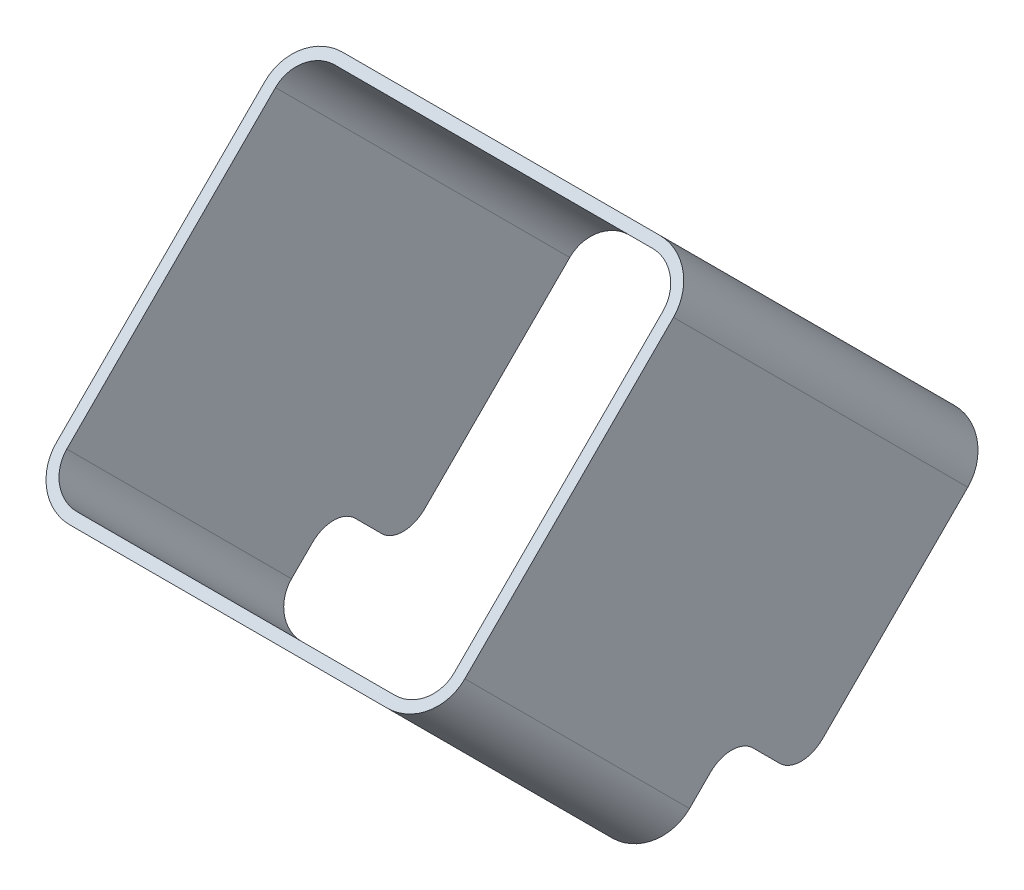
ISO-10303-21;
HEADER;
FILE_DESCRIPTION(('STEP AP214'),'2;1');
FILE_NAME('part.step','',(''),(''),'','','');
FILE_SCHEMA(('AUTOMOTIVE_DESIGN { 1 0 10303 214 1 1 1 1 }'));
ENDSEC;
DATA;
#1=APPLICATION_CONTEXT('core data for automotive mechanical design processes');
#2=APPLICATION_PROTOCOL_DEFINITION('international standard','automotive_design',2000,#1);
#3=PRODUCT_CONTEXT('',#1,'mechanical');
#4=PRODUCT('Part','Part','',(#3));
#5=PRODUCT_RELATED_PRODUCT_CATEGORY('part','',(#4));
#6=PRODUCT_DEFINITION_FORMATION('','',#4);
#7=PRODUCT_DEFINITION_CONTEXT('part definition',#1,'design');
#8=PRODUCT_DEFINITION('design','',#6,#7);
#9=PRODUCT_DEFINITION_SHAPE('','',#8);
#10=(LENGTH_UNIT() NAMED_UNIT(*) SI_UNIT(.MILLI.,.METRE.));
#11=(NAMED_UNIT(*) PLANE_ANGLE_UNIT() SI_UNIT($,.RADIAN.));
#12=(NAMED_UNIT(*) SI_UNIT($,.STERADIAN.) SOLID_ANGLE_UNIT());
#13=UNCERTAINTY_MEASURE_WITH_UNIT(LENGTH_MEASURE(1.E-05),#10,'distance_accuracy_value','');
#14=(GEOMETRIC_REPRESENTATION_CONTEXT(3) GLOBAL_UNCERTAINTY_ASSIGNED_CONTEXT((#13)) GLOBAL_UNIT_ASSIGNED_CONTEXT((#10,
#11,#12)) REPRESENTATION_CONTEXT('',''));
#15=CARTESIAN_POINT('',(0.,0.,0.));
#16=DIRECTION('',(0.,0.,1.));
#17=DIRECTION('',(1.,0.,0.));
#18=AXIS2_PLACEMENT_3D('',#15,#16,#17);
#19=CARTESIAN_POINT('',(73.0392137177238,-726.613094128826,-524.90850787991));
#20=DIRECTION('',(0.,0.707109355085686,0.70710420727804));
#21=DIRECTION('',(0.,-0.70710420727804,0.707109355085686));
#22=AXIS2_PLACEMENT_3D('',#19,#20,#21);
#23=CYLINDRICAL_SURFACE('',#22,2.3);
#24=CARTESIAN_POINT('',(73.0392137177238,-711.763797672026,-510.059319527071));
#25=DIRECTION('',(0.,0.707109355085686,0.70710420727804));
#26=DIRECTION('',(0.,-0.70710420727804,0.707109355085686));
#27=AXIS2_PLACEMENT_3D('',#24,#25,#26);
#28=CIRCLE('',#27,2.3);
#29=CARTESIAN_POINT('',(75.3392137177238,-711.763797672026,-510.059319527071));
#30=VERTEX_POINT('',#29);
#31=CARTESIAN_POINT('',(73.0392137177238,-713.390137348766,-508.432968010374));
#32=VERTEX_POINT('',#31);
#33=EDGE_CURVE('E294',#30,#32,#28,.F.);
#34=ORIENTED_EDGE('',*,*,#33,.F.);
#35=DIRECTION('',(0.,0.707109355085686,0.70710420727804));
#36=VECTOR('',#35,1.);
#37=CARTESIAN_POINT('',(75.3392137177238,-726.613094128826,-524.90850787991));
#38=LINE('',#37,#36);
#39=CARTESIAN_POINT('',(75.3392137177238,-726.613094128826,-524.90850787991));
#40=VERTEX_POINT('',#39);
#41=EDGE_CURVE('E334',#40,#30,#38,.T.);
#42=ORIENTED_EDGE('',*,*,#41,.F.);
#43=CARTESIAN_POINT('',(73.0392137177238,-726.613094128826,-524.90850787991));
#44=DIRECTION('',(0.,-0.707109355085686,-0.70710420727804));
#45=DIRECTION('',(1.,0.,0.));
#46=AXIS2_PLACEMENT_3D('',#43,#44,#45);
#47=CIRCLE('',#46,2.3);
#48=CARTESIAN_POINT('',(73.0392137177238,-728.239433805565,-523.282156363213));
#49=VERTEX_POINT('',#48);
#50=EDGE_CURVE('E324',#40,#49,#47,.T.);
#51=ORIENTED_EDGE('',*,*,#50,.T.);
#52=DIRECTION('',(0.,0.707109355085686,0.70710420727804));
#53=VECTOR('',#52,1.);
#54=CARTESIAN_POINT('',(73.0392137177238,-728.239433805565,-523.282156363213));
#55=LINE('',#54,#53);
#56=EDGE_CURVE('E329',#49,#32,#55,.T.);
#57=ORIENTED_EDGE('',*,*,#56,.T.);
#58=EDGE_LOOP('',(#34,#42,#51,#57));
#59=FACE_BOUND('',#58,.T.);
#60=ADVANCED_FACE('F16',(#59),#23,.F.);
#61=CARTESIAN_POINT('',(62.2040376067162,-728.239433805565,-523.282156363213));
#62=DIRECTION('',(0.,0.70710420727804,-0.707109355085686));
#63=DIRECTION('',(0.,0.707109355085686,0.70710420727804));
#64=AXIS2_PLACEMENT_3D('',#61,#62,#63);
#65=PLANE('',#64);
#66=DIRECTION('',(-1.,0.,0.));
#67=VECTOR('',#66,1.);
#68=CARTESIAN_POINT('',(62.5392137177238,-713.390137348766,-508.432968010374));
#69=LINE('',#68,#67);
#70=CARTESIAN_POINT('',(52.0392137177238,-713.390137348766,-508.432968010374));
#71=VERTEX_POINT('',#70);
#72=EDGE_CURVE('E376',#32,#71,#69,.T.);
#73=ORIENTED_EDGE('',*,*,#72,.F.);
#74=ORIENTED_EDGE('',*,*,#56,.F.);
#75=DIRECTION('',(-1.,0.,0.));
#76=VECTOR('',#75,1.);
#77=CARTESIAN_POINT('',(62.2040376067162,-728.239433805565,-523.282156363213));
#78=LINE('',#77,#76);
#79=CARTESIAN_POINT('',(52.0392137177238,-728.239433805565,-523.282156363213));
#80=VERTEX_POINT('',#79);
#81=EDGE_CURVE('E309',#49,#80,#78,.T.);
#82=ORIENTED_EDGE('',*,*,#81,.T.);
#83=DIRECTION('',(0.,0.707109355085686,0.70710420727804));
#84=VECTOR('',#83,1.);
#85=CARTESIAN_POINT('',(52.0392137177238,-728.239433805565,-523.282156363213));
#86=LINE('',#85,#84);
#87=EDGE_CURVE('E333',#80,#71,#86,.T.);
#88=ORIENTED_EDGE('',*,*,#87,.T.);
#89=EDGE_LOOP('',(#73,#74,#82,#88));
#90=FACE_BOUND('',#89,.T.);
#91=ADVANCED_FACE('F580',(#90),#65,.T.);
#92=CARTESIAN_POINT('',(52.0392137177238,-726.613094128826,-524.90850787991));
#93=DIRECTION('',(0.,0.707109355085686,0.70710420727804));
#94=DIRECTION('',(0.,-0.70710420727804,0.707109355085686));
#95=AXIS2_PLACEMENT_3D('',#92,#93,#94);
#96=CYLINDRICAL_SURFACE('',#95,2.3);
#97=CARTESIAN_POINT('',(52.0392137177238,-711.763797672026,-510.059319527071));
#98=DIRECTION('',(0.,0.707109355085686,0.70710420727804));
#99=DIRECTION('',(0.,-0.70710420727804,0.707109355085686));
#100=AXIS2_PLACEMENT_3D('',#97,#98,#99);
#101=CIRCLE('',#100,2.3);
#102=CARTESIAN_POINT('',(49.7392137177238,-711.763797672026,-510.059319527071));
#103=VERTEX_POINT('',#102);
#104=EDGE_CURVE('E424',#71,#103,#101,.F.);
#105=ORIENTED_EDGE('',*,*,#104,.F.);
#106=ORIENTED_EDGE('',*,*,#87,.F.);
#107=CARTESIAN_POINT('',(52.0392137177238,-726.613094128826,-524.90850787991));
#108=DIRECTION('',(0.,-0.707109355085686,-0.70710420727804));
#109=DIRECTION('',(0.,-0.707104207278068,0.707109355085658));
#110=AXIS2_PLACEMENT_3D('',#107,#108,#109);
#111=CIRCLE('',#110,2.3);
#112=CARTESIAN_POINT('',(49.7392137177238,-726.613094128826,-524.90850787991));
#113=VERTEX_POINT('',#112);
#114=EDGE_CURVE('E313',#80,#113,#111,.T.);
#115=ORIENTED_EDGE('',*,*,#114,.T.);
#116=DIRECTION('',(0.,0.707109355085686,0.70710420727804));
#117=VECTOR('',#116,1.);
#118=CARTESIAN_POINT('',(49.7392137177238,-726.613094128826,-524.90850787991));
#119=LINE('',#118,#117);
#120=EDGE_CURVE('E350',#113,#103,#119,.T.);
#121=ORIENTED_EDGE('',*,*,#120,.T.);
#122=EDGE_LOOP('',(#105,#106,#115,#121));
#123=FACE_BOUND('',#122,.T.);
#124=ADVANCED_FACE('F586',(#123),#96,.F.);
#125=CARTESIAN_POINT('',(49.7392137177238,-716.629178460247,-534.892496232651));
#126=DIRECTION('',(1.,0.,0.));
#127=DIRECTION('',(0.,0.,-1.));
#128=AXIS2_PLACEMENT_3D('',#125,#126,#127);
#129=PLANE('',#128);
#130=DIRECTION('',(0.,0.707109355085686,0.70710420727804));
#131=VECTOR('',#130,1.);
#132=CARTESIAN_POINT('',(49.7392137177238,-728.429866067909,-532.286972768276));
#133=LINE('',#132,#131);
#134=CARTESIAN_POINT('',(49.7392137177238,-727.014233139028,-530.871350145305));
#135=VERTEX_POINT('',#134);
#136=CARTESIAN_POINT('',(49.7392137177238,-725.246459751314,-529.10358962711));
#137=VERTEX_POINT('',#136);
#138=EDGE_CURVE('E280',#135,#137,#133,.T.);
#139=ORIENTED_EDGE('',*,*,#138,.F.);
#140=CARTESIAN_POINT('',(49.7392137177238,-725.600024724472,-532.285568855476));
#141=DIRECTION('',(1.,0.,0.));
#142=DIRECTION('',(0.,0.,-1.));
#143=AXIS2_PLACEMENT_3D('',#140,#141,#142);
#144=CIRCLE('',#143,2.);
#145=CARTESIAN_POINT('',(49.7392137177238,-727.014243434643,-533.699777270032));
#146=VERTEX_POINT('',#145);
#147=EDGE_CURVE('E447',#135,#146,#144,.T.);
#148=ORIENTED_EDGE('',*,*,#147,.T.);
#149=DIRECTION('',(0.,0.70710420727804,-0.707109355085686));
#150=VECTOR('',#149,1.);
#151=CARTESIAN_POINT('',(49.7392137177238,-721.225389268304,-539.488673579958));
#152=LINE('',#151,#150);
#153=CARTESIAN_POINT('',(49.7392137177238,-717.420772894961,-543.293317651388));
#154=VERTEX_POINT('',#153);
#155=EDGE_CURVE('E517',#146,#154,#152,.T.);
#156=ORIENTED_EDGE('',*,*,#155,.T.);
#157=DIRECTION('',(0.,0.707109355085686,0.70710420727804));
#158=VECTOR('',#157,1.);
#159=CARTESIAN_POINT('',(49.7392137177238,-712.824562086904,-538.697140304081));
#160=LINE('',#159,#158);
#161=CARTESIAN_POINT('',(49.7392137177238,-697.975265630105,-523.847951951242));
#162=VERTEX_POINT('',#161);
#163=EDGE_CURVE('E347',#154,#162,#160,.T.);
#164=ORIENTED_EDGE('',*,*,#163,.T.);
#165=DIRECTION('',(0.,0.70710420727804,-0.707109355085686));
#166=VECTOR('',#165,1.);
#167=CARTESIAN_POINT('',(49.7392137177238,-706.637292169261,-515.185862351442));
#168=LINE('',#167,#166);
#169=EDGE_CURVE('E420',#103,#162,#168,.T.);
#170=ORIENTED_EDGE('',*,*,#169,.F.);
#171=ORIENTED_EDGE('',*,*,#120,.F.);
#172=DIRECTION('',(0.,0.70710420727804,-0.707109355085686));
#173=VECTOR('',#172,1.);
#174=CARTESIAN_POINT('',(49.7392137177238,-716.629178460247,-534.892496232651));
#175=LINE('',#174,#173);
#176=CARTESIAN_POINT('',(49.7392137177238,-725.246449455698,-526.275162502383));
#177=VERTEX_POINT('',#176);
#178=EDGE_CURVE('E317',#113,#177,#175,.T.);
#179=ORIENTED_EDGE('',*,*,#178,.T.);
#180=CARTESIAN_POINT('',(49.7392137177238,-726.66066816587,-527.689370916939));
#181=DIRECTION('',(1.,0.,0.));
#182=DIRECTION('',(0.,0.,-1.));
#183=AXIS2_PLACEMENT_3D('',#180,#181,#182);
#184=CIRCLE('',#183,2.);
#185=EDGE_CURVE('E470',#177,#137,#184,.F.);
#186=ORIENTED_EDGE('',*,*,#185,.T.);
#187=EDGE_LOOP('',(#139,#148,#156,#164,#170,#171,#179,#186));
#188=FACE_BOUND('',#187,.T.);
#189=ADVANCED_FACE('F601',(#188),#129,.T.);
#190=CARTESIAN_POINT('',(52.0392137177238,-712.824562086904,-538.697140304081));
#191=DIRECTION('',(0.,0.707109355085686,0.70710420727804));
#192=DIRECTION('',(0.,-0.70710420727804,0.707109355085686));
#193=AXIS2_PLACEMENT_3D('',#190,#191,#192);
#194=CYLINDRICAL_SURFACE('',#193,2.3);
#195=CARTESIAN_POINT('',(52.0392137177238,-697.975265630105,-523.847951951242));
#196=DIRECTION('',(0.,0.707109355085686,0.70710420727804));
#197=DIRECTION('',(0.,-0.70710420727804,0.707109355085686));
#198=AXIS2_PLACEMENT_3D('',#195,#196,#197);
#199=CIRCLE('',#198,2.3);
#200=CARTESIAN_POINT('',(52.0392137177238,-696.348925953365,-525.474303467939));
#201=VERTEX_POINT('',#200);
#202=EDGE_CURVE('E416',#162,#201,#199,.F.);
#203=ORIENTED_EDGE('',*,*,#202,.F.);
#204=ORIENTED_EDGE('',*,*,#163,.F.);
#205=CARTESIAN_POINT('',(52.0392137177238,-717.420772894961,-543.293317651388));
#206=DIRECTION('',(0.,-0.707109355085686,-0.70710420727804));
#207=DIRECTION('',(0.,0.70710420727804,-0.707109355085686));
#208=AXIS2_PLACEMENT_3D('',#205,#206,#207);
#209=CIRCLE('',#208,2.3);
#210=CARTESIAN_POINT('',(52.0392137177238,-715.794433218221,-544.919669168085));
#211=VERTEX_POINT('',#210);
#212=EDGE_CURVE('E521',#154,#211,#209,.T.);
#213=ORIENTED_EDGE('',*,*,#212,.T.);
#214=DIRECTION('',(0.,0.707109355085686,0.70710420727804));
#215=VECTOR('',#214,1.);
#216=CARTESIAN_POINT('',(52.0392137177238,-711.198222410165,-540.323491820778));
#217=LINE('',#216,#215);
#218=EDGE_CURVE('E344',#211,#201,#217,.T.);
#219=ORIENTED_EDGE('',*,*,#218,.T.);
#220=EDGE_LOOP('',(#203,#204,#213,#219));
#221=FACE_BOUND('',#220,.T.);
#222=ADVANCED_FACE('F537',(#221),#194,.F.);
#223=CARTESIAN_POINT('',(62.5392137177238,-711.198222410165,-540.323491820778));
#224=DIRECTION('',(0.,0.70710420727804,-0.707109355085686));
#225=DIRECTION('',(0.,0.707109355085686,0.70710420727804));
#226=AXIS2_PLACEMENT_3D('',#223,#224,#225);
#227=PLANE('',#226);
#228=DIRECTION('',(-1.,0.,0.));
#229=VECTOR('',#228,1.);
#230=CARTESIAN_POINT('',(62.5392137177238,-696.348925953365,-525.474303467939));
#231=LINE('',#230,#229);
#232=CARTESIAN_POINT('',(73.0392137177238,-696.348925953365,-525.474303467939));
#233=VERTEX_POINT('',#232);
#234=EDGE_CURVE('E412',#233,#201,#231,.T.);
#235=ORIENTED_EDGE('',*,*,#234,.T.);
#236=ORIENTED_EDGE('',*,*,#218,.F.);
#237=DIRECTION('',(-1.,0.,0.));
#238=VECTOR('',#237,1.);
#239=CARTESIAN_POINT('',(62.5392137177238,-715.794433218221,-544.919669168085));
#240=LINE('',#239,#238);
#241=CARTESIAN_POINT('',(73.0392137177238,-715.794433218221,-544.919669168085));
#242=VERTEX_POINT('',#241);
#243=EDGE_CURVE('E493',#242,#211,#240,.T.);
#244=ORIENTED_EDGE('',*,*,#243,.F.);
#245=DIRECTION('',(0.,0.707109355085686,0.70710420727804));
#246=VECTOR('',#245,1.);
#247=CARTESIAN_POINT('',(73.0392137177238,-711.198222410165,-540.323491820778));
#248=LINE('',#247,#246);
#249=EDGE_CURVE('E341',#242,#233,#248,.T.);
#250=ORIENTED_EDGE('',*,*,#249,.T.);
#251=EDGE_LOOP('',(#235,#236,#244,#250));
#252=FACE_BOUND('',#251,.T.);
#253=ADVANCED_FACE('F532',(#252),#227,.F.);
#254=CARTESIAN_POINT('',(73.0392137177238,-712.824562086904,-538.697140304081));
#255=DIRECTION('',(0.,0.707109355085686,0.70710420727804));
#256=DIRECTION('',(0.,-0.70710420727804,0.707109355085686));
#257=AXIS2_PLACEMENT_3D('',#254,#255,#256);
#258=CYLINDRICAL_SURFACE('',#257,2.3);
#259=CARTESIAN_POINT('',(73.0392137177238,-697.975265630105,-523.847951951242));
#260=DIRECTION('',(0.,0.707109355085686,0.70710420727804));
#261=DIRECTION('',(0.,-0.70710420727804,0.707109355085686));
#262=AXIS2_PLACEMENT_3D('',#259,#260,#261);
#263=CIRCLE('',#262,2.3);
#264=CARTESIAN_POINT('',(75.3392137177238,-697.975265630105,-523.847951951242));
#265=VERTEX_POINT('',#264);
#266=EDGE_CURVE('E408',#233,#265,#263,.F.);
#267=ORIENTED_EDGE('',*,*,#266,.F.);
#268=ORIENTED_EDGE('',*,*,#249,.F.);
#269=CARTESIAN_POINT('',(73.0392137177238,-717.420772894961,-543.293317651388));
#270=DIRECTION('',(0.,-0.707109355085686,-0.70710420727804));
#271=DIRECTION('',(0.,0.70710420727804,-0.707109355085686));
#272=AXIS2_PLACEMENT_3D('',#269,#270,#271);
#273=CIRCLE('',#272,2.3);
#274=CARTESIAN_POINT('',(75.3392137177238,-717.420772894961,-543.293317651388));
#275=VERTEX_POINT('',#274);
#276=EDGE_CURVE('E243',#242,#275,#273,.T.);
#277=ORIENTED_EDGE('',*,*,#276,.T.);
#278=DIRECTION('',(0.,0.707109355085686,0.70710420727804));
#279=VECTOR('',#278,1.);
#280=CARTESIAN_POINT('',(75.3392137177238,-712.824562086904,-538.697140304081));
#281=LINE('',#280,#279);
#282=EDGE_CURVE('E337',#275,#265,#281,.T.);
#283=ORIENTED_EDGE('',*,*,#282,.T.);
#284=EDGE_LOOP('',(#267,#268,#277,#283));
#285=FACE_BOUND('',#284,.T.);
#286=ADVANCED_FACE('F528',(#285),#258,.F.);
#287=CARTESIAN_POINT('',(52.0392137177238,-726.613094128826,-524.90850787991));
#288=DIRECTION('',(0.,0.707109355085686,0.70710420727804));
#289=DIRECTION('',(0.,-0.70710420727804,0.707109355085686));
#290=AXIS2_PLACEMENT_3D('',#287,#288,#289);
#291=CYLINDRICAL_SURFACE('',#290,3.);
#292=CARTESIAN_POINT('',(52.0392137177238,-711.763797672026,-510.059319527071));
#293=DIRECTION('',(0.,0.707109355085686,0.70710420727804));
#294=DIRECTION('',(0.,-0.70710420727804,0.707109355085686));
#295=AXIS2_PLACEMENT_3D('',#292,#293,#294);
#296=CIRCLE('',#295,3.);
#297=CARTESIAN_POINT('',(52.0392137177238,-713.885110293861,-507.937991461814));
#298=VERTEX_POINT('',#297);
#299=CARTESIAN_POINT('',(49.0392137177238,-711.763797672026,-510.059319527071));
#300=VERTEX_POINT('',#299);
#301=EDGE_CURVE('E372',#298,#300,#296,.F.);
#302=ORIENTED_EDGE('',*,*,#301,.T.);
#303=DIRECTION('',(0.,0.707109355085686,0.70710420727804));
#304=VECTOR('',#303,1.);
#305=CARTESIAN_POINT('',(49.0392137177238,-726.613094128826,-524.90850787991));
#306=LINE('',#305,#304);
#307=CARTESIAN_POINT('',(49.0392137177238,-726.613094128826,-524.90850787991));
#308=VERTEX_POINT('',#307);
#309=EDGE_CURVE('E328',#308,#300,#306,.T.);
#310=ORIENTED_EDGE('',*,*,#309,.F.);
#311=CARTESIAN_POINT('',(52.0392137177238,-726.613094128826,-524.90850787991));
#312=DIRECTION('',(0.,-0.707109355085686,-0.70710420727804));
#313=DIRECTION('',(0.,-0.707104207278051,0.707109355085675));
#314=AXIS2_PLACEMENT_3D('',#311,#312,#313);
#315=CIRCLE('',#314,3.);
#316=CARTESIAN_POINT('',(52.0392137177238,-728.73440675066,-522.787179814653));
#317=VERTEX_POINT('',#316);
#318=EDGE_CURVE('E305',#317,#308,#315,.T.);
#319=ORIENTED_EDGE('',*,*,#318,.F.);
#320=DIRECTION('',(0.,0.707109355085686,0.70710420727804));
#321=VECTOR('',#320,1.);
#322=CARTESIAN_POINT('',(52.0392137177238,-728.73440675066,-522.787179814653));
#323=LINE('',#322,#321);
#324=EDGE_CURVE('E338',#317,#298,#323,.T.);
#325=ORIENTED_EDGE('',*,*,#324,.T.);
#326=EDGE_LOOP('',(#302,#310,#319,#325));
#327=FACE_BOUND('',#326,.T.);
#328=ADVANCED_FACE('F557',(#327),#291,.T.);
#329=CARTESIAN_POINT('',(62.2040376067162,-728.73440675066,-522.787179814653));
#330=DIRECTION('',(0.,0.70710420727804,-0.707109355085686));
#331=DIRECTION('',(0.,0.707109355085686,0.70710420727804));
#332=AXIS2_PLACEMENT_3D('',#329,#330,#331);
#333=PLANE('',#332);
#334=DIRECTION('',(-1.,0.,0.));
#335=VECTOR('',#334,1.);
#336=CARTESIAN_POINT('',(62.5392137177238,-713.885110293861,-507.937991461814));
#337=LINE('',#336,#335);
#338=CARTESIAN_POINT('',(73.0392137177238,-713.885110293861,-507.937991461814));
#339=VERTEX_POINT('',#338);
#340=EDGE_CURVE('E288',#339,#298,#337,.T.);
#341=ORIENTED_EDGE('',*,*,#340,.T.);
#342=ORIENTED_EDGE('',*,*,#324,.F.);
#343=DIRECTION('',(-1.,0.,0.));
#344=VECTOR('',#343,1.);
#345=CARTESIAN_POINT('',(62.2040376067162,-728.73440675066,-522.787179814653));
#346=LINE('',#345,#344);
#347=CARTESIAN_POINT('',(73.0392137177238,-728.73440675066,-522.787179814653));
#348=VERTEX_POINT('',#347);
#349=EDGE_CURVE('E289',#348,#317,#346,.T.);
#350=ORIENTED_EDGE('',*,*,#349,.F.);
#351=DIRECTION('',(0.,0.707109355085686,0.70710420727804));
#352=VECTOR('',#351,1.);
#353=CARTESIAN_POINT('',(73.0392137177238,-728.73440675066,-522.787179814653));
#354=LINE('',#353,#352);
#355=EDGE_CURVE('E357',#348,#339,#354,.T.);
#356=ORIENTED_EDGE('',*,*,#355,.T.);
#357=EDGE_LOOP('',(#341,#342,#350,#356));
#358=FACE_BOUND('',#357,.T.);
#359=ADVANCED_FACE('F568',(#358),#333,.F.);
#360=CARTESIAN_POINT('',(73.0392137177238,-726.613094128826,-524.90850787991));
#361=DIRECTION('',(0.,0.707109355085686,0.70710420727804));
#362=DIRECTION('',(0.,-0.70710420727804,0.707109355085686));
#363=AXIS2_PLACEMENT_3D('',#360,#361,#362);
#364=CYLINDRICAL_SURFACE('',#363,3.);
#365=CARTESIAN_POINT('',(73.0392137177238,-711.763797672026,-510.059319527071));
#366=DIRECTION('',(0.,0.707109355085686,0.70710420727804));
#367=DIRECTION('',(0.,-0.70710420727804,0.707109355085686));
#368=AXIS2_PLACEMENT_3D('',#365,#366,#367);
#369=CIRCLE('',#368,3.);
#370=CARTESIAN_POINT('',(76.0392137177238,-711.763797672026,-510.059319527071));
#371=VERTEX_POINT('',#370);
#372=EDGE_CURVE('E394',#371,#339,#369,.F.);
#373=ORIENTED_EDGE('',*,*,#372,.T.);
#374=ORIENTED_EDGE('',*,*,#355,.F.);
#375=CARTESIAN_POINT('',(73.0392137177238,-726.613094128826,-524.90850787991));
#376=DIRECTION('',(0.,-0.707109355085686,-0.70710420727804));
#377=DIRECTION('',(1.,0.,0.));
#378=AXIS2_PLACEMENT_3D('',#375,#376,#377);
#379=CIRCLE('',#378,3.);
#380=CARTESIAN_POINT('',(76.0392137177238,-726.613094128826,-524.90850787991));
#381=VERTEX_POINT('',#380);
#382=EDGE_CURVE('E293',#381,#348,#379,.T.);
#383=ORIENTED_EDGE('',*,*,#382,.F.);
#384=DIRECTION('',(0.,0.707109355085686,0.70710420727804));
#385=VECTOR('',#384,1.);
#386=CARTESIAN_POINT('',(76.0392137177238,-726.613094128826,-524.90850787991));
#387=LINE('',#386,#385);
#388=EDGE_CURVE('E254',#381,#371,#387,.T.);
#389=ORIENTED_EDGE('',*,*,#388,.T.);
#390=EDGE_LOOP('',(#373,#374,#383,#389));
#391=FACE_BOUND('',#390,.T.);
#392=ADVANCED_FACE('F566',(#391),#364,.T.);
#393=CARTESIAN_POINT('',(76.0392137177238,-718.499736553846,-533.021924521155));
#394=DIRECTION('',(1.,0.,0.));
#395=DIRECTION('',(0.,0.,-1.));
#396=AXIS2_PLACEMENT_3D('',#393,#394,#395);
#397=PLANE('',#396);
#398=DIRECTION('',(0.,0.707109355085686,0.70710420727804));
#399=VECTOR('',#398,1.);
#400=CARTESIAN_POINT('',(76.0392137177238,-728.429866067909,-532.286972768276));
#401=LINE('',#400,#399);
#402=CARTESIAN_POINT('',(76.0392137177238,-727.014233139028,-530.871350145305));
#403=VERTEX_POINT('',#402);
#404=CARTESIAN_POINT('',(76.0392137177238,-725.246459751314,-529.10358962711));
#405=VERTEX_POINT('',#404);
#406=EDGE_CURVE('E273',#403,#405,#401,.T.);
#407=ORIENTED_EDGE('',*,*,#406,.F.);
#408=CARTESIAN_POINT('',(76.0392137177238,-725.600024724472,-532.285568855476));
#409=DIRECTION('',(1.,0.,0.));
#410=DIRECTION('',(0.,0.,-1.));
#411=AXIS2_PLACEMENT_3D('',#408,#409,#410);
#412=CIRCLE('',#411,2.);
#413=CARTESIAN_POINT('',(76.0392137177238,-727.014243434643,-533.699777270032));
#414=VERTEX_POINT('',#413);
#415=EDGE_CURVE('E237',#403,#414,#412,.T.);
#416=ORIENTED_EDGE('',*,*,#415,.T.);
#417=DIRECTION('',(0.,0.70710420727804,-0.707109355085686));
#418=VECTOR('',#417,1.);
#419=CARTESIAN_POINT('',(76.0392137177238,-723.095947361902,-537.618101868462));
#420=LINE('',#419,#418);
#421=CARTESIAN_POINT('',(76.0392137177238,-717.420772894961,-543.293317651388));
#422=VERTEX_POINT('',#421);
#423=EDGE_CURVE('E230',#414,#422,#420,.T.);
#424=ORIENTED_EDGE('',*,*,#423,.T.);
#425=DIRECTION('',(0.,0.707109355085686,0.70710420727804));
#426=VECTOR('',#425,1.);
#427=CARTESIAN_POINT('',(76.0392137177238,-712.824562086904,-538.697140304081));
#428=LINE('',#427,#426);
#429=CARTESIAN_POINT('',(76.0392137177238,-697.975265630105,-523.847951951242));
#430=VERTEX_POINT('',#429);
#431=EDGE_CURVE('E234',#422,#430,#428,.T.);
#432=ORIENTED_EDGE('',*,*,#431,.T.);
#433=DIRECTION('',(0.,0.70710420727804,-0.707109355085686));
#434=VECTOR('',#433,1.);
#435=CARTESIAN_POINT('',(76.0392137177238,-706.637292169261,-515.185862351442));
#436=LINE('',#435,#434);
#437=EDGE_CURVE('E391',#371,#430,#436,.T.);
#438=ORIENTED_EDGE('',*,*,#437,.F.);
#439=ORIENTED_EDGE('',*,*,#388,.F.);
#440=DIRECTION('',(0.,0.70710420727804,-0.707109355085686));
#441=VECTOR('',#440,1.);
#442=CARTESIAN_POINT('',(76.0392137177238,-718.499736553846,-533.021924521155));
#443=LINE('',#442,#441);
#444=CARTESIAN_POINT('',(76.0392137177238,-725.246449455698,-526.275162502383));
#445=VERTEX_POINT('',#444);
#446=EDGE_CURVE('E298',#381,#445,#443,.T.);
#447=ORIENTED_EDGE('',*,*,#446,.T.);
#448=CARTESIAN_POINT('',(76.0392137177238,-726.66066816587,-527.689370916939));
#449=DIRECTION('',(1.,0.,0.));
#450=DIRECTION('',(0.,0.,-1.));
#451=AXIS2_PLACEMENT_3D('',#448,#449,#450);
#452=CIRCLE('',#451,2.);
#453=EDGE_CURVE('E10',#445,#405,#452,.F.);
#454=ORIENTED_EDGE('',*,*,#453,.T.);
#455=EDGE_LOOP('',(#407,#416,#424,#432,#438,#439,#447,#454));
#456=FACE_BOUND('',#455,.T.);
#457=ADVANCED_FACE('F232',(#456),#397,.T.);
#458=CARTESIAN_POINT('',(73.0392137177238,-712.824562086904,-538.697140304081));
#459=DIRECTION('',(0.,0.707109355085686,0.70710420727804));
#460=DIRECTION('',(0.,-0.70710420727804,0.707109355085686));
#461=AXIS2_PLACEMENT_3D('',#458,#459,#460);
#462=CYLINDRICAL_SURFACE('',#461,3.);
#463=CARTESIAN_POINT('',(73.0392137177238,-697.975265630105,-523.847951951242));
#464=DIRECTION('',(0.,0.707109355085686,0.70710420727804));
#465=DIRECTION('',(0.,-0.70710420727804,0.707109355085686));
#466=AXIS2_PLACEMENT_3D('',#463,#464,#465);
#467=CIRCLE('',#466,3.);
#468=CARTESIAN_POINT('',(73.0392137177238,-695.85395300827,-525.969280016499));
#469=VERTEX_POINT('',#468);
#470=EDGE_CURVE('E251',#469,#430,#467,.F.);
#471=ORIENTED_EDGE('',*,*,#470,.T.);
#472=ORIENTED_EDGE('',*,*,#431,.F.);
#473=CARTESIAN_POINT('',(73.0392137177238,-717.420772894961,-543.293317651388));
#474=DIRECTION('',(0.,-0.707109355085686,-0.70710420727804));
#475=DIRECTION('',(0.,0.70710420727804,-0.707109355085686));
#476=AXIS2_PLACEMENT_3D('',#473,#474,#475);
#477=CIRCLE('',#476,3.);
#478=CARTESIAN_POINT('',(73.0392137177238,-715.299460273127,-545.414645716645));
#479=VERTEX_POINT('',#478);
#480=EDGE_CURVE('E249',#479,#422,#477,.T.);
#481=ORIENTED_EDGE('',*,*,#480,.F.);
#482=DIRECTION('',(0.,0.707109355085686,0.70710420727804));
#483=VECTOR('',#482,1.);
#484=CARTESIAN_POINT('',(73.0392137177238,-710.70324946507,-540.818468369338));
#485=LINE('',#484,#483);
#486=EDGE_CURVE('E255',#479,#469,#485,.T.);
#487=ORIENTED_EDGE('',*,*,#486,.T.);
#488=EDGE_LOOP('',(#471,#472,#481,#487));
#489=FACE_BOUND('',#488,.T.);
#490=ADVANCED_FACE('F248',(#489),#462,.T.);
#491=CARTESIAN_POINT('',(62.5392137177238,-710.70324946507,-540.818468369338));
#492=DIRECTION('',(0.,0.70710420727804,-0.707109355085686));
#493=DIRECTION('',(0.,0.707109355085686,0.70710420727804));
#494=AXIS2_PLACEMENT_3D('',#491,#492,#493);
#495=PLANE('',#494);
#496=DIRECTION('',(-1.,0.,0.));
#497=VECTOR('',#496,1.);
#498=CARTESIAN_POINT('',(62.5392137177238,-695.85395300827,-525.969280016499));
#499=LINE('',#498,#497);
#500=CARTESIAN_POINT('',(52.0392137177238,-695.853953008271,-525.969280016499));
#501=VERTEX_POINT('',#500);
#502=EDGE_CURVE('E385',#469,#501,#499,.T.);
#503=ORIENTED_EDGE('',*,*,#502,.F.);
#504=ORIENTED_EDGE('',*,*,#486,.F.);
#505=DIRECTION('',(-1.,0.,0.));
#506=VECTOR('',#505,1.);
#507=CARTESIAN_POINT('',(62.5392137177238,-715.299460273127,-545.414645716645));
#508=LINE('',#507,#506);
#509=CARTESIAN_POINT('',(52.0392137177238,-715.299460273127,-545.414645716645));
#510=VERTEX_POINT('',#509);
#511=EDGE_CURVE('E262',#479,#510,#508,.T.);
#512=ORIENTED_EDGE('',*,*,#511,.T.);
#513=DIRECTION('',(0.,0.707109355085686,0.70710420727804));
#514=VECTOR('',#513,1.);
#515=CARTESIAN_POINT('',(52.0392137177238,-710.70324946507,-540.818468369338));
#516=LINE('',#515,#514);
#517=EDGE_CURVE('E363',#510,#501,#516,.T.);
#518=ORIENTED_EDGE('',*,*,#517,.T.);
#519=EDGE_LOOP('',(#503,#504,#512,#518));
#520=FACE_BOUND('',#519,.T.);
#521=ADVANCED_FACE('F515',(#520),#495,.T.);
#522=CARTESIAN_POINT('',(52.0392137177238,-712.824562086904,-538.697140304081));
#523=DIRECTION('',(0.,0.707109355085686,0.70710420727804));
#524=DIRECTION('',(0.,-0.70710420727804,0.707109355085686));
#525=AXIS2_PLACEMENT_3D('',#522,#523,#524);
#526=CYLINDRICAL_SURFACE('',#525,3.);
#527=CARTESIAN_POINT('',(52.0392137177238,-697.975265630105,-523.847951951242));
#528=DIRECTION('',(0.,0.707109355085686,0.70710420727804));
#529=DIRECTION('',(0.,-0.70710420727804,0.707109355085686));
#530=AXIS2_PLACEMENT_3D('',#527,#528,#529);
#531=CIRCLE('',#530,3.);
#532=CARTESIAN_POINT('',(49.0392137177238,-697.975265630105,-523.847951951242));
#533=VERTEX_POINT('',#532);
#534=EDGE_CURVE('E381',#533,#501,#531,.F.);
#535=ORIENTED_EDGE('',*,*,#534,.T.);
#536=ORIENTED_EDGE('',*,*,#517,.F.);
#537=CARTESIAN_POINT('',(52.0392137177238,-717.420772894961,-543.293317651388));
#538=DIRECTION('',(0.,-0.707109355085686,-0.70710420727804));
#539=DIRECTION('',(0.,0.70710420727804,-0.707109355085686));
#540=AXIS2_PLACEMENT_3D('',#537,#538,#539);
#541=CIRCLE('',#540,3.);
#542=CARTESIAN_POINT('',(49.0392137177238,-717.420772894961,-543.293317651388));
#543=VERTEX_POINT('',#542);
#544=EDGE_CURVE('E264',#543,#510,#541,.T.);
#545=ORIENTED_EDGE('',*,*,#544,.F.);
#546=DIRECTION('',(0.,0.707109355085686,0.70710420727804));
#547=VECTOR('',#546,1.);
#548=CARTESIAN_POINT('',(49.0392137177238,-712.824562086904,-538.697140304081));
#549=LINE('',#548,#547);
#550=EDGE_CURVE('E360',#543,#533,#549,.T.);
#551=ORIENTED_EDGE('',*,*,#550,.T.);
#552=EDGE_LOOP('',(#535,#536,#545,#551));
#553=FACE_BOUND('',#552,.T.);
#554=ADVANCED_FACE('F512',(#553),#526,.T.);
#555=CARTESIAN_POINT('',(49.0392137177238,-716.629178460247,-534.892496232651));
#556=DIRECTION('',(1.,0.,0.));
#557=DIRECTION('',(0.,0.,-1.));
#558=AXIS2_PLACEMENT_3D('',#555,#556,#557);
#559=PLANE('',#558);
#560=DIRECTION('',(0.,0.70710420727804,-0.707109355085686));
#561=VECTOR('',#560,1.);
#562=CARTESIAN_POINT('',(49.0392137177238,-721.225389268304,-539.488673579958));
#563=LINE('',#562,#561);
#564=CARTESIAN_POINT('',(49.0392137177238,-727.014243434643,-533.699777270032));
#565=VERTEX_POINT('',#564);
#566=EDGE_CURVE('E269',#565,#543,#563,.T.);
#567=ORIENTED_EDGE('',*,*,#566,.F.);
#568=CARTESIAN_POINT('',(49.0392137177238,-725.600024724472,-532.285568855476));
#569=DIRECTION('',(1.,0.,0.));
#570=DIRECTION('',(0.,0.,-1.));
#571=AXIS2_PLACEMENT_3D('',#568,#569,#570);
#572=CIRCLE('',#571,2.);
#573=CARTESIAN_POINT('',(49.0392137177238,-727.014233139028,-530.871350145305));
#574=VERTEX_POINT('',#573);
#575=EDGE_CURVE('E437',#565,#574,#572,.F.);
#576=ORIENTED_EDGE('',*,*,#575,.T.);
#577=DIRECTION('',(0.,0.707109355085686,0.70710420727804));
#578=VECTOR('',#577,1.);
#579=CARTESIAN_POINT('',(49.0392137177238,-728.429866067909,-532.286972768276));
#580=LINE('',#579,#578);
#581=CARTESIAN_POINT('',(49.0392137177238,-725.246459751314,-529.10358962711));
#582=VERTEX_POINT('',#581);
#583=EDGE_CURVE('E284',#574,#582,#580,.T.);
#584=ORIENTED_EDGE('',*,*,#583,.T.);
#585=CARTESIAN_POINT('',(49.0392137177238,-726.66066816587,-527.689370916939));
#586=DIRECTION('',(1.,0.,0.));
#587=DIRECTION('',(0.,0.,-1.));
#588=AXIS2_PLACEMENT_3D('',#585,#586,#587);
#589=CIRCLE('',#588,2.);
#590=CARTESIAN_POINT('',(49.0392137177238,-725.246449455698,-526.275162502383));
#591=VERTEX_POINT('',#590);
#592=EDGE_CURVE('E467',#582,#591,#589,.T.);
#593=ORIENTED_EDGE('',*,*,#592,.T.);
#594=DIRECTION('',(0.,0.70710420727804,-0.707109355085686));
#595=VECTOR('',#594,1.);
#596=CARTESIAN_POINT('',(49.0392137177238,-716.629178460247,-534.892496232651));
#597=LINE('',#596,#595);
#598=EDGE_CURVE('E301',#308,#591,#597,.T.);
#599=ORIENTED_EDGE('',*,*,#598,.F.);
#600=ORIENTED_EDGE('',*,*,#309,.T.);
#601=DIRECTION('',(0.,0.70710420727804,-0.707109355085686));
#602=VECTOR('',#601,1.);
#603=CARTESIAN_POINT('',(49.0392137177238,-706.637292169261,-515.185862351442));
#604=LINE('',#603,#602);
#605=EDGE_CURVE('E377',#300,#533,#604,.T.);
#606=ORIENTED_EDGE('',*,*,#605,.T.);
#607=ORIENTED_EDGE('',*,*,#550,.F.);
#608=EDGE_LOOP('',(#567,#576,#584,#593,#599,#600,#606,#607));
#609=FACE_BOUND('',#608,.T.);
#610=ADVANCED_FACE('F508',(#609),#559,.F.);
#611=CARTESIAN_POINT('',(75.3392137177238,-718.499736553846,-533.021924521155));
#612=DIRECTION('',(1.,0.,0.));
#613=DIRECTION('',(0.,0.,-1.));
#614=AXIS2_PLACEMENT_3D('',#611,#612,#613);
#615=PLANE('',#614);
#616=DIRECTION('',(0.,0.70710420727804,-0.707109355085686));
#617=VECTOR('',#616,1.);
#618=CARTESIAN_POINT('',(75.3392137177238,-723.095947361902,-537.618101868462));
#619=LINE('',#618,#617);
#620=CARTESIAN_POINT('',(75.3392137177238,-727.014243434643,-533.699777270032));
#621=VERTEX_POINT('',#620);
#622=EDGE_CURVE('E244',#621,#275,#619,.T.);
#623=ORIENTED_EDGE('',*,*,#622,.F.);
#624=CARTESIAN_POINT('',(75.3392137177238,-725.600024724472,-532.285568855476));
#625=DIRECTION('',(1.,0.,0.));
#626=DIRECTION('',(0.,0.,-1.));
#627=AXIS2_PLACEMENT_3D('',#624,#625,#626);
#628=CIRCLE('',#627,2.);
#629=CARTESIAN_POINT('',(75.3392137177238,-727.014233139028,-530.871350145305));
#630=VERTEX_POINT('',#629);
#631=EDGE_CURVE('E450',#621,#630,#628,.F.);
#632=ORIENTED_EDGE('',*,*,#631,.T.);
#633=DIRECTION('',(0.,0.707109355085686,0.70710420727804));
#634=VECTOR('',#633,1.);
#635=CARTESIAN_POINT('',(75.3392137177238,-728.429866067909,-532.286972768276));
#636=LINE('',#635,#634);
#637=CARTESIAN_POINT('',(75.3392137177238,-725.246459751314,-529.10358962711));
#638=VERTEX_POINT('',#637);
#639=EDGE_CURVE('E276',#630,#638,#636,.T.);
#640=ORIENTED_EDGE('',*,*,#639,.T.);
#641=CARTESIAN_POINT('',(75.3392137177238,-726.66066816587,-527.689370916939));
#642=DIRECTION('',(1.,0.,0.));
#643=DIRECTION('',(0.,0.,-1.));
#644=AXIS2_PLACEMENT_3D('',#641,#642,#643);
#645=CIRCLE('',#644,2.);
#646=CARTESIAN_POINT('',(75.3392137177238,-725.246449455698,-526.275162502383));
#647=VERTEX_POINT('',#646);
#648=EDGE_CURVE('E25',#638,#647,#645,.T.);
#649=ORIENTED_EDGE('',*,*,#648,.T.);
#650=DIRECTION('',(0.,0.70710420727804,-0.707109355085686));
#651=VECTOR('',#650,1.);
#652=CARTESIAN_POINT('',(75.3392137177238,-718.499736553846,-533.021924521155));
#653=LINE('',#652,#651);
#654=EDGE_CURVE('E321',#40,#647,#653,.T.);
#655=ORIENTED_EDGE('',*,*,#654,.F.);
#656=ORIENTED_EDGE('',*,*,#41,.T.);
#657=DIRECTION('',(0.,0.70710420727804,-0.707109355085686));
#658=VECTOR('',#657,1.);
#659=CARTESIAN_POINT('',(75.3392137177238,-706.637292169261,-515.185862351442));
#660=LINE('',#659,#658);
#661=EDGE_CURVE('E404',#30,#265,#660,.T.);
#662=ORIENTED_EDGE('',*,*,#661,.T.);
#663=ORIENTED_EDGE('',*,*,#282,.F.);
#664=EDGE_LOOP('',(#623,#632,#640,#649,#655,#656,#662,#663));
#665=FACE_BOUND('',#664,.T.);
#666=ADVANCED_FACE('F477',(#665),#615,.F.);
#667=CARTESIAN_POINT('',(62.5392137177238,-721.48658862606,-530.035050704281));
#668=DIRECTION('',(0.,0.707109355085686,0.70710420727804));
#669=DIRECTION('',(-1.,0.,0.));
#670=AXIS2_PLACEMENT_3D('',#667,#668,#669);
#671=PLANE('',#670);
#672=ORIENTED_EDGE('',*,*,#598,.T.);
#673=DIRECTION('',(-1.,0.,0.));
#674=VECTOR('',#673,1.);
#675=CARTESIAN_POINT('',(49.7392137177238,-725.246449455698,-526.275162502383));
#676=LINE('',#675,#674);
#677=EDGE_CURVE('E464',#591,#177,#676,.F.);
#678=ORIENTED_EDGE('',*,*,#677,.T.);
#679=ORIENTED_EDGE('',*,*,#178,.F.);
#680=ORIENTED_EDGE('',*,*,#114,.F.);
#681=ORIENTED_EDGE('',*,*,#81,.F.);
#682=ORIENTED_EDGE('',*,*,#50,.F.);
#683=ORIENTED_EDGE('',*,*,#654,.T.);
#684=DIRECTION('',(-1.,0.,0.));
#685=VECTOR('',#684,1.);
#686=CARTESIAN_POINT('',(76.0392137177238,-725.246449455698,-526.275162502383));
#687=LINE('',#686,#685);
#688=EDGE_CURVE('E37',#647,#445,#687,.F.);
#689=ORIENTED_EDGE('',*,*,#688,.T.);
#690=ORIENTED_EDGE('',*,*,#446,.F.);
#691=ORIENTED_EDGE('',*,*,#382,.T.);
#692=ORIENTED_EDGE('',*,*,#349,.T.);
#693=ORIENTED_EDGE('',*,*,#318,.T.);
#694=EDGE_LOOP('',(#672,#678,#679,#680,#681,#682,#683,#689,#690,#691,#692,#693));
#695=FACE_BOUND('',#694,.T.);
#696=ADVANCED_FACE('F482',(#695),#671,.F.);
#697=CARTESIAN_POINT('',(62.5392137177238,-706.637292169261,-515.185862351442));
#698=DIRECTION('',(0.,0.707109355085686,0.70710420727804));
#699=DIRECTION('',(-1.,0.,0.));
#700=AXIS2_PLACEMENT_3D('',#697,#698,#699);
#701=PLANE('',#700);
#702=ORIENTED_EDGE('',*,*,#301,.F.);
#703=ORIENTED_EDGE('',*,*,#340,.F.);
#704=ORIENTED_EDGE('',*,*,#372,.F.);
#705=ORIENTED_EDGE('',*,*,#437,.T.);
#706=ORIENTED_EDGE('',*,*,#470,.F.);
#707=ORIENTED_EDGE('',*,*,#502,.T.);
#708=ORIENTED_EDGE('',*,*,#534,.F.);
#709=ORIENTED_EDGE('',*,*,#605,.F.);
#710=EDGE_LOOP('',(#702,#703,#704,#705,#706,#707,#708,#709));
#711=FACE_BOUND('',#710,.T.);
#712=ORIENTED_EDGE('',*,*,#33,.T.);
#713=ORIENTED_EDGE('',*,*,#72,.T.);
#714=ORIENTED_EDGE('',*,*,#104,.T.);
#715=ORIENTED_EDGE('',*,*,#169,.T.);
#716=ORIENTED_EDGE('',*,*,#202,.T.);
#717=ORIENTED_EDGE('',*,*,#234,.F.);
#718=ORIENTED_EDGE('',*,*,#266,.T.);
#719=ORIENTED_EDGE('',*,*,#661,.F.);
#720=EDGE_LOOP('',(#712,#713,#714,#715,#716,#717,#718,#719));
#721=FACE_BOUND('',#720,.T.);
#722=ADVANCED_FACE('F560',(#711,#721),#701,.T.);
#723=CARTESIAN_POINT('',(62.5392137177238,-724.315038915922,-536.399001439302));
#724=DIRECTION('',(0.,-0.707109355085686,-0.70710420727804));
#725=DIRECTION('',(1.,0.,0.));
#726=AXIS2_PLACEMENT_3D('',#723,#724,#725);
#727=PLANE('',#726);
#728=ORIENTED_EDGE('',*,*,#155,.F.);
#729=DIRECTION('',(-1.,0.,0.));
#730=VECTOR('',#729,1.);
#731=CARTESIAN_POINT('',(49.0392137177238,-727.014243434643,-533.699777270032));
#732=LINE('',#731,#730);
#733=EDGE_CURVE('E433',#146,#565,#732,.T.);
#734=ORIENTED_EDGE('',*,*,#733,.T.);
#735=ORIENTED_EDGE('',*,*,#566,.T.);
#736=ORIENTED_EDGE('',*,*,#544,.T.);
#737=ORIENTED_EDGE('',*,*,#511,.F.);
#738=ORIENTED_EDGE('',*,*,#480,.T.);
#739=ORIENTED_EDGE('',*,*,#423,.F.);
#740=DIRECTION('',(-1.,0.,0.));
#741=VECTOR('',#740,1.);
#742=CARTESIAN_POINT('',(75.3392137177238,-727.014243434643,-533.699777270032));
#743=LINE('',#742,#741);
#744=EDGE_CURVE('E332',#414,#621,#743,.T.);
#745=ORIENTED_EDGE('',*,*,#744,.T.);
#746=ORIENTED_EDGE('',*,*,#622,.T.);
#747=ORIENTED_EDGE('',*,*,#276,.F.);
#748=ORIENTED_EDGE('',*,*,#243,.T.);
#749=ORIENTED_EDGE('',*,*,#212,.F.);
#750=EDGE_LOOP('',(#728,#734,#735,#736,#737,#738,#739,#745,#746,#747,#748,#749));
#751=FACE_BOUND('',#750,.T.);
#752=ADVANCED_FACE('F259',(#751),#727,.T.);
#753=CARTESIAN_POINT('',(62.5392137177238,-728.42986606791,-532.286972768276));
#754=DIRECTION('',(0.,0.70710420727804,-0.707109355085686));
#755=DIRECTION('',(0.,0.707109355085686,0.70710420727804));
#756=AXIS2_PLACEMENT_3D('',#753,#754,#755);
#757=PLANE('',#756);
#758=ORIENTED_EDGE('',*,*,#639,.F.);
#759=DIRECTION('',(-1.,0.,0.));
#760=VECTOR('',#759,1.);
#761=CARTESIAN_POINT('',(76.0392137177238,-727.014233139028,-530.871350145305));
#762=LINE('',#761,#760);
#763=EDGE_CURVE('E457',#630,#403,#762,.F.);
#764=ORIENTED_EDGE('',*,*,#763,.T.);
#765=ORIENTED_EDGE('',*,*,#406,.T.);
#766=DIRECTION('',(-1.,0.,0.));
#767=VECTOR('',#766,1.);
#768=CARTESIAN_POINT('',(75.3392137177238,-725.246459751314,-529.10358962711));
#769=LINE('',#768,#767);
#770=EDGE_CURVE('E453',#405,#638,#769,.T.);
#771=ORIENTED_EDGE('',*,*,#770,.T.);
#772=EDGE_LOOP('',(#758,#764,#765,#771));
#773=FACE_BOUND('',#772,.T.);
#774=ADVANCED_FACE('F485',(#773),#757,.F.);
#775=ORIENTED_EDGE('',*,*,#583,.F.);
#776=DIRECTION('',(-1.,0.,0.));
#777=VECTOR('',#776,1.);
#778=CARTESIAN_POINT('',(49.7392137177238,-727.014233139028,-530.871350145305));
#779=LINE('',#778,#777);
#780=EDGE_CURVE('E444',#574,#135,#779,.F.);
#781=ORIENTED_EDGE('',*,*,#780,.T.);
#782=ORIENTED_EDGE('',*,*,#138,.T.);
#783=DIRECTION('',(-1.,0.,0.));
#784=VECTOR('',#783,1.);
#785=CARTESIAN_POINT('',(49.0392137177238,-725.246459751314,-529.10358962711));
#786=LINE('',#785,#784);
#787=EDGE_CURVE('E440',#137,#582,#786,.T.);
#788=ORIENTED_EDGE('',*,*,#787,.T.);
#789=EDGE_LOOP('',(#775,#781,#782,#788));
#790=FACE_BOUND('',#789,.T.);
#791=ADVANCED_FACE('F545',(#790),#757,.F.);
#792=CARTESIAN_POINT('',(62.5392137177238,-725.600024724472,-532.285568855476));
#793=DIRECTION('',(1.,0.,0.));
#794=DIRECTION('',(0.,0.,-1.));
#795=AXIS2_PLACEMENT_3D('',#792,#793,#794);
#796=CYLINDRICAL_SURFACE('',#795,2.);
#797=ORIENTED_EDGE('',*,*,#147,.F.);
#798=ORIENTED_EDGE('',*,*,#780,.F.);
#799=ORIENTED_EDGE('',*,*,#575,.F.);
#800=ORIENTED_EDGE('',*,*,#733,.F.);
#801=EDGE_LOOP('',(#797,#798,#799,#800));
#802=FACE_BOUND('',#801,.T.);
#803=ADVANCED_FACE('F541',(#802),#796,.T.);
#804=CARTESIAN_POINT('',(62.5392137177238,-725.600024724472,-532.285568855476));
#805=DIRECTION('',(1.,0.,0.));
#806=DIRECTION('',(0.,0.,-1.));
#807=AXIS2_PLACEMENT_3D('',#804,#805,#806);
#808=CYLINDRICAL_SURFACE('',#807,2.);
#809=ORIENTED_EDGE('',*,*,#415,.F.);
#810=ORIENTED_EDGE('',*,*,#763,.F.);
#811=ORIENTED_EDGE('',*,*,#631,.F.);
#812=ORIENTED_EDGE('',*,*,#744,.F.);
#813=EDGE_LOOP('',(#809,#810,#811,#812));
#814=FACE_BOUND('',#813,.T.);
#815=ADVANCED_FACE('F488',(#814),#808,.T.);
#816=CARTESIAN_POINT('',(62.5392137177238,-726.66066816587,-527.689370916939));
#817=DIRECTION('',(1.,0.,0.));
#818=DIRECTION('',(0.,0.,-1.));
#819=AXIS2_PLACEMENT_3D('',#816,#817,#818);
#820=CYLINDRICAL_SURFACE('',#819,2.);
#821=ORIENTED_EDGE('',*,*,#185,.F.);
#822=ORIENTED_EDGE('',*,*,#677,.F.);
#823=ORIENTED_EDGE('',*,*,#592,.F.);
#824=ORIENTED_EDGE('',*,*,#787,.F.);
#825=EDGE_LOOP('',(#821,#822,#823,#824));
#826=FACE_BOUND('',#825,.T.);
#827=ADVANCED_FACE('F550',(#826),#820,.F.);
#828=CARTESIAN_POINT('',(62.5392137177238,-726.66066816587,-527.689370916939));
#829=DIRECTION('',(1.,0.,0.));
#830=DIRECTION('',(0.,0.,-1.));
#831=AXIS2_PLACEMENT_3D('',#828,#829,#830);
#832=CYLINDRICAL_SURFACE('',#831,2.);
#833=ORIENTED_EDGE('',*,*,#453,.F.);
#834=ORIENTED_EDGE('',*,*,#688,.F.);
#835=ORIENTED_EDGE('',*,*,#648,.F.);
#836=ORIENTED_EDGE('',*,*,#770,.F.);
#837=EDGE_LOOP('',(#833,#834,#835,#836));
#838=FACE_BOUND('',#837,.T.);
#839=ADVANCED_FACE('F18',(#838),#832,.F.);
#840=CLOSED_SHELL('',(#60,#91,#124,#189,#222,#253,#286,#328,#359,#392,#457,#490,#521,#554,#610,
#666,#696,#722,#752,#774,#791,#803,#815,#827,#839));
#841=MANIFOLD_SOLID_BREP('B1',#840);
#842=ADVANCED_BREP_SHAPE_REPRESENTATION('',(#18,#841),#14);
#843=SHAPE_DEFINITION_REPRESENTATION(#9,#842);
ENDSEC;
END-ISO-10303-21;
